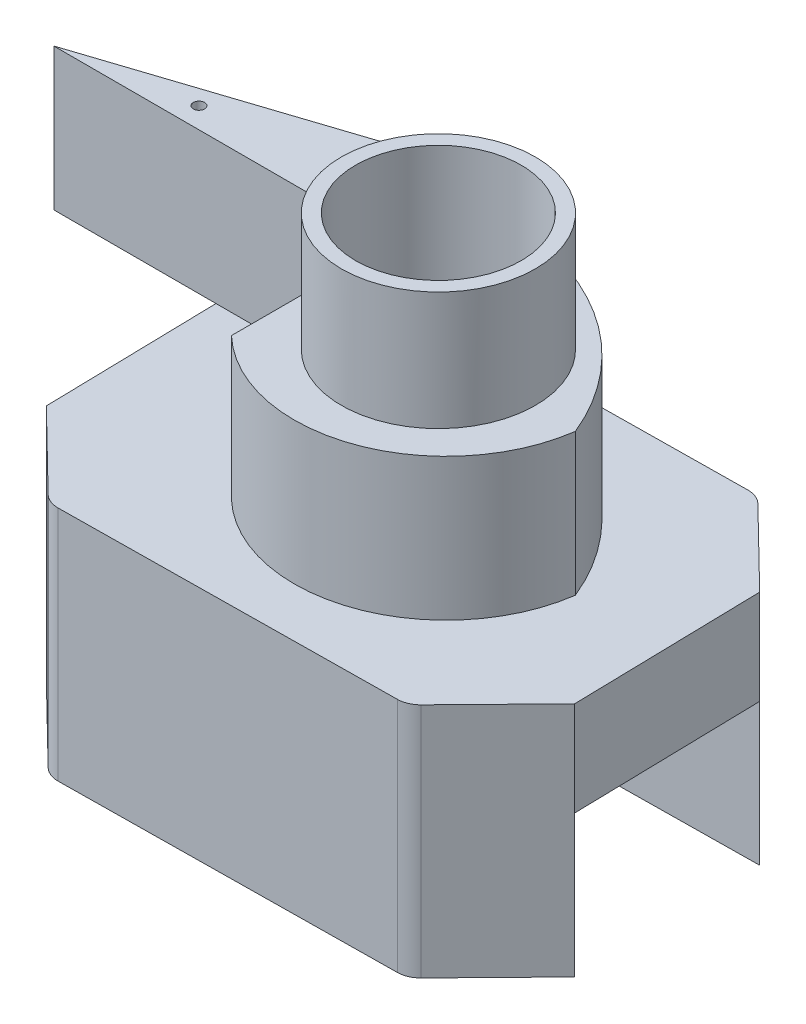
ISO-10303-21;
HEADER;
FILE_DESCRIPTION(('STEP AP214'),'2;1');
FILE_NAME('part.step','',(''),(''),'','','');
FILE_SCHEMA(('AUTOMOTIVE_DESIGN { 1 0 10303 214 1 1 1 1 }'));
ENDSEC;
DATA;
#1=APPLICATION_CONTEXT('core data for automotive mechanical design processes');
#2=APPLICATION_PROTOCOL_DEFINITION('international standard','automotive_design',2000,#1);
#3=PRODUCT_CONTEXT('',#1,'mechanical');
#4=PRODUCT('Part','Part','',(#3));
#5=PRODUCT_RELATED_PRODUCT_CATEGORY('part','',(#4));
#6=PRODUCT_DEFINITION_FORMATION('','',#4);
#7=PRODUCT_DEFINITION_CONTEXT('part definition',#1,'design');
#8=PRODUCT_DEFINITION('design','',#6,#7);
#9=PRODUCT_DEFINITION_SHAPE('','',#8);
#10=(LENGTH_UNIT() NAMED_UNIT(*) SI_UNIT(.MILLI.,.METRE.));
#11=(NAMED_UNIT(*) PLANE_ANGLE_UNIT() SI_UNIT($,.RADIAN.));
#12=(NAMED_UNIT(*) SI_UNIT($,.STERADIAN.) SOLID_ANGLE_UNIT());
#13=UNCERTAINTY_MEASURE_WITH_UNIT(LENGTH_MEASURE(1.E-05),#10,'distance_accuracy_value','');
#14=(GEOMETRIC_REPRESENTATION_CONTEXT(3) GLOBAL_UNCERTAINTY_ASSIGNED_CONTEXT((#13)) GLOBAL_UNIT_ASSIGNED_CONTEXT((#10,
#11,#12)) REPRESENTATION_CONTEXT('',''));
#15=CARTESIAN_POINT('',(0.,0.,0.));
#16=DIRECTION('',(0.,0.,1.));
#17=DIRECTION('',(1.,0.,0.));
#18=AXIS2_PLACEMENT_3D('',#15,#16,#17);
#19=CARTESIAN_POINT('',(0.,10.,0.));
#20=DIRECTION('',(0.,1.,0.));
#21=DIRECTION('',(0.,0.,1.));
#22=AXIS2_PLACEMENT_3D('',#19,#20,#21);
#23=PLANE('',#22);
#24=DIRECTION('',(-0.999930540162387,0.,0.0117862144285722));
#25=VECTOR('',#24,1.);
#26=CARTESIAN_POINT('',(8.21244562560331,10.,-7.40100076017394));
#27=LINE('',#26,#25);
#28=CARTESIAN_POINT('',(-4.09509511372916,10.,-7.25593136943546));
#29=VERTEX_POINT('',#28);
#30=CARTESIAN_POINT('',(-6.37336910363204,10.,-7.22907727838262));
#31=VERTEX_POINT('',#30);
#32=EDGE_CURVE('E265',#29,#31,#27,.T.);
#33=ORIENTED_EDGE('',*,*,#32,.T.);
#34=CARTESIAN_POINT('',(-6.36158288920348,10.,-6.22914673822024));
#35=DIRECTION('',(0.,1.,0.));
#36=DIRECTION('',(0.,0.,1.));
#37=AXIS2_PLACEMENT_3D('',#34,#35,#36);
#38=CIRCLE('',#37,1.);
#39=CARTESIAN_POINT('',(-7.07697523911702,10.,-6.92786970598728));
#40=VERTEX_POINT('',#39);
#41=EDGE_CURVE('E47',#31,#40,#38,.T.);
#42=ORIENTED_EDGE('',*,*,#41,.T.);
#43=DIRECTION('',(-0.69872296776704,0.,0.715392349913542));
#44=VECTOR('',#43,1.);
#45=CARTESIAN_POINT('',(-6.78755437439669,10.,-7.22419526286423));
#46=LINE('',#45,#44);
#47=CARTESIAN_POINT('',(-8.01213913003781,10.,-5.97039567930956));
#48=VERTEX_POINT('',#47);
#49=EDGE_CURVE('E272',#40,#48,#46,.T.);
#50=ORIENTED_EDGE('',*,*,#49,.T.);
#51=DIRECTION('',(-0.950139094586096,0.,0.311826395513776));
#52=VECTOR('',#51,1.);
#53=CARTESIAN_POINT('',(-17.1215909230103,10.,-2.98076233626041));
#54=LINE('',#53,#52);
#55=EDGE_CURVE('E209',#29,#48,#54,.T.);
#56=ORIENTED_EDGE('',*,*,#55,.F.);
#57=EDGE_LOOP('',(#33,#42,#50,#56));
#58=FACE_BOUND('',#57,.T.);
#59=ADVANCED_FACE('F38',(#58),#23,.T.);
#60=CARTESIAN_POINT('',(-10.2811692132319,10.,-3.64723351329652));
#61=DIRECTION('',(0.999755869242295,0.,-0.0220952917062123));
#62=DIRECTION('',(-0.0220952917062123,0.,-0.999755869242295));
#63=AXIS2_PLACEMENT_3D('',#60,#61,#62);
#64=PLANE('',#63);
#65=DIRECTION('',(0.0220952917062123,0.,0.999755869242295));
#66=VECTOR('',#65,1.);
#67=CARTESIAN_POINT('',(-10.1043637159222,6.,4.35276648670348));
#68=LINE('',#67,#66);
#69=CARTESIAN_POINT('',(-10.2811692132319,6.,-3.64723351329652));
#70=VERTEX_POINT('',#69);
#71=CARTESIAN_POINT('',(-10.1043637159222,6.,4.35276648670348));
#72=VERTEX_POINT('',#71);
#73=EDGE_CURVE('E227',#70,#72,#68,.T.);
#74=ORIENTED_EDGE('',*,*,#73,.T.);
#75=DIRECTION('',(0.,-1.,0.));
#76=VECTOR('',#75,1.);
#77=CARTESIAN_POINT('',(-10.1043637159222,10.,4.35276648670348));
#78=LINE('',#77,#76);
#79=CARTESIAN_POINT('',(-10.1043637159222,10.,4.35276648670348));
#80=VERTEX_POINT('',#79);
#81=EDGE_CURVE('E318',#80,#72,#78,.T.);
#82=ORIENTED_EDGE('',*,*,#81,.F.);
#83=DIRECTION('',(0.0220952917062123,0.,0.999755869242295));
#84=VECTOR('',#83,1.);
#85=CARTESIAN_POINT('',(-10.2811692132319,10.,-3.64723351329652));
#86=LINE('',#85,#84);
#87=CARTESIAN_POINT('',(-10.2664397422446,10.,-2.98076233626041));
#88=VERTEX_POINT('',#87);
#89=EDGE_CURVE('E275',#88,#80,#86,.T.);
#90=ORIENTED_EDGE('',*,*,#89,.F.);
#91=CARTESIAN_POINT('',(-10.2811692132319,10.,-3.64723351329652));
#92=VERTEX_POINT('',#91);
#93=EDGE_CURVE('E276',#92,#88,#86,.T.);
#94=ORIENTED_EDGE('',*,*,#93,.F.);
#95=DIRECTION('',(0.,-1.,0.));
#96=VECTOR('',#95,1.);
#97=CARTESIAN_POINT('',(-10.2811692132319,10.,-3.64723351329652));
#98=LINE('',#97,#96);
#99=EDGE_CURVE('E322',#92,#70,#98,.T.);
#100=ORIENTED_EDGE('',*,*,#99,.T.);
#101=EDGE_LOOP('',(#74,#82,#90,#94,#100));
#102=FACE_BOUND('',#101,.T.);
#103=ADVANCED_FACE('F415',(#102),#64,.F.);
#104=CARTESIAN_POINT('',(11.9662128724807,10.,4.09261407866126));
#105=DIRECTION('',(-0.999755869242295,0.,0.0220952917062113));
#106=DIRECTION('',(0.0220952917062113,0.,0.999755869242295));
#107=AXIS2_PLACEMENT_3D('',#104,#105,#106);
#108=PLANE('',#107);
#109=DIRECTION('',(-0.0220952917062113,0.,-0.999755869242295));
#110=VECTOR('',#109,1.);
#111=CARTESIAN_POINT('',(11.789407375171,6.,-3.90738592133874));
#112=LINE('',#111,#110);
#113=CARTESIAN_POINT('',(11.9662128724807,6.,4.09261407866126));
#114=VERTEX_POINT('',#113);
#115=CARTESIAN_POINT('',(11.789407375171,6.,-3.90738592133874));
#116=VERTEX_POINT('',#115);
#117=EDGE_CURVE('E234',#114,#116,#112,.T.);
#118=ORIENTED_EDGE('',*,*,#117,.T.);
#119=DIRECTION('',(0.,-1.,0.));
#120=VECTOR('',#119,1.);
#121=CARTESIAN_POINT('',(11.789407375171,10.,-3.90738592133874));
#122=LINE('',#121,#120);
#123=CARTESIAN_POINT('',(11.789407375171,10.,-3.90738592133874));
#124=VERTEX_POINT('',#123);
#125=EDGE_CURVE('E293',#124,#116,#122,.T.);
#126=ORIENTED_EDGE('',*,*,#125,.F.);
#127=DIRECTION('',(-0.0220952917062113,0.,-0.999755869242295));
#128=VECTOR('',#127,1.);
#129=CARTESIAN_POINT('',(11.9662128724807,10.,4.09261407866126));
#130=LINE('',#129,#128);
#131=CARTESIAN_POINT('',(11.9662128724807,10.,4.09261407866126));
#132=VERTEX_POINT('',#131);
#133=EDGE_CURVE('E290',#132,#124,#130,.T.);
#134=ORIENTED_EDGE('',*,*,#133,.F.);
#135=DIRECTION('',(0.,-1.,0.));
#136=VECTOR('',#135,1.);
#137=CARTESIAN_POINT('',(11.9662128724807,10.,4.09261407866126));
#138=LINE('',#137,#136);
#139=EDGE_CURVE('E314',#132,#114,#138,.T.);
#140=ORIENTED_EDGE('',*,*,#139,.T.);
#141=EDGE_LOOP('',(#118,#126,#134,#140));
#142=FACE_BOUND('',#141,.T.);
#143=ADVANCED_FACE('F406',(#142),#108,.F.);
#144=CARTESIAN_POINT('',(0.,0.,0.));
#145=DIRECTION('',(0.,1.,0.));
#146=DIRECTION('',(0.,0.,1.));
#147=AXIS2_PLACEMENT_3D('',#144,#145,#146);
#148=PLANE('',#147);
#149=DIRECTION('',(0.999930540162387,0.,-0.0117862144285723));
#150=VECTOR('',#149,1.);
#151=CARTESIAN_POINT('',(-6.52740196635446,0.,7.84638132553868));
#152=LINE('',#151,#150);
#153=CARTESIAN_POINT('',(-6.1132176547863,0.,7.84149932132637));
#154=VERTEX_POINT('',#153);
#155=CARTESIAN_POINT('',(8.05841276288089,0.,7.67445784374736));
#156=VERTEX_POINT('',#155);
#157=EDGE_CURVE('E306',#154,#156,#152,.T.);
#158=ORIENTED_EDGE('',*,*,#157,.F.);
#159=CARTESIAN_POINT('',(-6.12500386921488,0.,6.84156878116398));
#160=DIRECTION('',(0.,1.,0.));
#161=DIRECTION('',(0.,0.,1.));
#162=AXIS2_PLACEMENT_3D('',#159,#160,#161);
#163=CIRCLE('',#162,1.);
#164=CARTESIAN_POINT('',(-6.82372683698192,0.,7.55696113107753));
#165=VERTEX_POINT('',#164);
#166=EDGE_CURVE('E349',#154,#165,#163,.F.);
#167=ORIENTED_EDGE('',*,*,#166,.T.);
#168=DIRECTION('',(0.715392349913542,0.,0.69872296776704));
#169=VECTOR('',#168,1.);
#170=CARTESIAN_POINT('',(-10.1043637159222,0.,4.35276648670348));
#171=LINE('',#170,#169);
#172=CARTESIAN_POINT('',(-10.1043637159222,0.,4.35276648670348));
#173=VERTEX_POINT('',#172);
#174=EDGE_CURVE('E302',#173,#165,#171,.T.);
#175=ORIENTED_EDGE('',*,*,#174,.F.);
#176=DIRECTION('',(0.999930537070749,0.,-0.0117864767171782));
#177=VECTOR('',#176,1.);
#178=CARTESIAN_POINT('',(11.9662128724807,0.,4.09261407866126));
#179=LINE('',#178,#177);
#180=CARTESIAN_POINT('',(11.9662128724807,0.,4.09261407866126));
#181=VERTEX_POINT('',#180);
#182=EDGE_CURVE('E216',#173,#181,#179,.T.);
#183=ORIENTED_EDGE('',*,*,#182,.T.);
#184=DIRECTION('',(0.69872296776704,0.,-0.715392349913542));
#185=VECTOR('',#184,1.);
#186=CARTESIAN_POINT('',(8.47259803364553,0.,7.66957582822897));
#187=LINE('',#186,#185);
#188=CARTESIAN_POINT('',(8.76201889836586,0.,7.37325027135201));
#189=VERTEX_POINT('',#188);
#190=EDGE_CURVE('E266',#189,#181,#187,.T.);
#191=ORIENTED_EDGE('',*,*,#190,.F.);
#192=CARTESIAN_POINT('',(8.04662654845232,0.,6.67452730358497));
#193=DIRECTION('',(0.,1.,0.));
#194=DIRECTION('',(0.,0.,1.));
#195=AXIS2_PLACEMENT_3D('',#192,#193,#194);
#196=CIRCLE('',#195,1.);
#197=EDGE_CURVE('E334',#189,#156,#196,.F.);
#198=ORIENTED_EDGE('',*,*,#197,.T.);
#199=EDGE_LOOP('',(#158,#167,#175,#183,#191,#198));
#200=FACE_BOUND('',#199,.T.);
#201=ADVANCED_FACE('F515',(#200),#148,.F.);
#202=DIRECTION('',(-0.69872296776704,0.,0.715392349913542));
#203=VECTOR('',#202,1.);
#204=CARTESIAN_POINT('',(-6.78755437439669,0.,-7.22419526286423));
#205=LINE('',#204,#203);
#206=CARTESIAN_POINT('',(-7.07697523911702,0.,-6.92786970598728));
#207=VERTEX_POINT('',#206);
#208=CARTESIAN_POINT('',(-10.2811692132319,0.,-3.64723351329652));
#209=VERTEX_POINT('',#208);
#210=EDGE_CURVE('E299',#207,#209,#205,.T.);
#211=ORIENTED_EDGE('',*,*,#210,.F.);
#212=CARTESIAN_POINT('',(-6.36158288920348,0.,-6.22914673822024));
#213=DIRECTION('',(0.,1.,0.));
#214=DIRECTION('',(0.,0.,1.));
#215=AXIS2_PLACEMENT_3D('',#212,#213,#214);
#216=CIRCLE('',#215,1.);
#217=CARTESIAN_POINT('',(-6.37336910363204,0.,-7.22907727838262));
#218=VERTEX_POINT('',#217);
#219=EDGE_CURVE('E367',#207,#218,#216,.F.);
#220=ORIENTED_EDGE('',*,*,#219,.T.);
#221=DIRECTION('',(-0.999930540162387,0.,0.0117862144285722));
#222=VECTOR('',#221,1.);
#223=CARTESIAN_POINT('',(8.21244562560331,0.,-7.40100076017394));
#224=LINE('',#223,#222);
#225=CARTESIAN_POINT('',(7.79826131403516,0.,-7.39611875596163));
#226=VERTEX_POINT('',#225);
#227=EDGE_CURVE('E296',#226,#218,#224,.T.);
#228=ORIENTED_EDGE('',*,*,#227,.F.);
#229=CARTESIAN_POINT('',(7.81004752846373,0.,-6.39618821579924));
#230=DIRECTION('',(0.,1.,0.));
#231=DIRECTION('',(0.,0.,1.));
#232=AXIS2_PLACEMENT_3D('',#229,#230,#231);
#233=CIRCLE('',#232,1.);
#234=CARTESIAN_POINT('',(8.50877049623077,0.,-7.11158056571279));
#235=VERTEX_POINT('',#234);
#236=EDGE_CURVE('E62',#226,#235,#233,.F.);
#237=ORIENTED_EDGE('',*,*,#236,.T.);
#238=DIRECTION('',(-0.715392349913542,0.,-0.698722967767041));
#239=VECTOR('',#238,1.);
#240=CARTESIAN_POINT('',(11.789407375171,0.,-3.90738592133874));
#241=LINE('',#240,#239);
#242=CARTESIAN_POINT('',(11.789407375171,0.,-3.90738592133874));
#243=VERTEX_POINT('',#242);
#244=EDGE_CURVE('E260',#243,#235,#241,.T.);
#245=ORIENTED_EDGE('',*,*,#244,.F.);
#246=DIRECTION('',(-0.999930537070748,0.,0.0117864767171781));
#247=VECTOR('',#246,1.);
#248=CARTESIAN_POINT('',(-10.2811692132319,0.,-3.64723351329652));
#249=LINE('',#248,#247);
#250=EDGE_CURVE('E221',#243,#209,#249,.T.);
#251=ORIENTED_EDGE('',*,*,#250,.T.);
#252=EDGE_LOOP('',(#211,#220,#228,#237,#245,#251));
#253=FACE_BOUND('',#252,.T.);
#254=ADVANCED_FACE('F388',(#253),#148,.F.);
#255=CARTESIAN_POINT('',(11.789407375171,10.,-3.90738592133874));
#256=DIRECTION('',(-0.698722967767041,0.,0.715392349913542));
#257=DIRECTION('',(0.715392349913542,0.,0.698722967767041));
#258=AXIS2_PLACEMENT_3D('',#255,#256,#257);
#259=PLANE('',#258);
#260=ORIENTED_EDGE('',*,*,#244,.T.);
#261=DIRECTION('',(0.,-1.,0.));
#262=VECTOR('',#261,1.);
#263=CARTESIAN_POINT('',(8.50877049623077,10.,-7.11158056571279));
#264=LINE('',#263,#262);
#265=CARTESIAN_POINT('',(8.50877049623077,10.,-7.11158056571279));
#266=VERTEX_POINT('',#265);
#267=EDGE_CURVE('E11',#235,#266,#264,.F.);
#268=ORIENTED_EDGE('',*,*,#267,.T.);
#269=DIRECTION('',(-0.715392349913542,0.,-0.698722967767041));
#270=VECTOR('',#269,1.);
#271=CARTESIAN_POINT('',(11.789407375171,10.,-3.90738592133874));
#272=LINE('',#271,#270);
#273=EDGE_CURVE('E261',#124,#266,#272,.T.);
#274=ORIENTED_EDGE('',*,*,#273,.F.);
#275=ORIENTED_EDGE('',*,*,#125,.T.);
#276=DIRECTION('',(0.,-1.,0.));
#277=VECTOR('',#276,1.);
#278=CARTESIAN_POINT('',(11.789407375171,6.,-3.90738592133874));
#279=LINE('',#278,#277);
#280=EDGE_CURVE('E248',#116,#243,#279,.T.);
#281=ORIENTED_EDGE('',*,*,#280,.T.);
#282=EDGE_LOOP('',(#260,#268,#274,#275,#281));
#283=FACE_BOUND('',#282,.T.);
#284=ADVANCED_FACE('F398',(#283),#259,.F.);
#285=CARTESIAN_POINT('',(8.21244562560331,10.,-7.40100076017394));
#286=DIRECTION('',(0.0117862144285722,0.,0.999930540162387));
#287=DIRECTION('',(0.999930540162387,0.,-0.0117862144285722));
#288=AXIS2_PLACEMENT_3D('',#285,#286,#287);
#289=PLANE('',#288);
#290=ORIENTED_EDGE('',*,*,#227,.T.);
#291=DIRECTION('',(0.,-1.,0.));
#292=VECTOR('',#291,1.);
#293=CARTESIAN_POINT('',(-6.37336910363205,10.,-7.22907727838262));
#294=LINE('',#293,#292);
#295=EDGE_CURVE('E54',#218,#31,#294,.F.);
#296=ORIENTED_EDGE('',*,*,#295,.T.);
#297=ORIENTED_EDGE('',*,*,#32,.F.);
#298=CARTESIAN_POINT('',(-3.48196735983012,10.,-7.26315832659829));
#299=VERTEX_POINT('',#298);
#300=EDGE_CURVE('E271',#299,#29,#27,.T.);
#301=ORIENTED_EDGE('',*,*,#300,.F.);
#302=CARTESIAN_POINT('',(7.79826131403516,10.,-7.39611875596163));
#303=VERTEX_POINT('',#302);
#304=EDGE_CURVE('E267',#303,#299,#27,.T.);
#305=ORIENTED_EDGE('',*,*,#304,.F.);
#306=DIRECTION('',(0.,-1.,0.));
#307=VECTOR('',#306,1.);
#308=CARTESIAN_POINT('',(7.79826131403516,10.,-7.39611875596163));
#309=LINE('',#308,#307);
#310=EDGE_CURVE('E370',#303,#226,#309,.T.);
#311=ORIENTED_EDGE('',*,*,#310,.T.);
#312=EDGE_LOOP('',(#290,#296,#297,#301,#305,#311));
#313=FACE_BOUND('',#312,.T.);
#314=ADVANCED_FACE('F389',(#313),#289,.F.);
#315=CARTESIAN_POINT('',(-6.78755437439669,10.,-7.22419526286423));
#316=DIRECTION('',(0.715392349913542,0.,0.69872296776704));
#317=DIRECTION('',(0.69872296776704,0.,-0.715392349913542));
#318=AXIS2_PLACEMENT_3D('',#315,#316,#317);
#319=PLANE('',#318);
#320=ORIENTED_EDGE('',*,*,#49,.F.);
#321=DIRECTION('',(0.,-1.,0.));
#322=VECTOR('',#321,1.);
#323=CARTESIAN_POINT('',(-7.07697523911702,10.,-6.92786970598728));
#324=LINE('',#323,#322);
#325=EDGE_CURVE('E361',#40,#207,#324,.T.);
#326=ORIENTED_EDGE('',*,*,#325,.T.);
#327=ORIENTED_EDGE('',*,*,#210,.T.);
#328=DIRECTION('',(0.,-1.,0.));
#329=VECTOR('',#328,1.);
#330=CARTESIAN_POINT('',(-10.2811692132319,6.,-3.64723351329652));
#331=LINE('',#330,#329);
#332=EDGE_CURVE('E240',#70,#209,#331,.T.);
#333=ORIENTED_EDGE('',*,*,#332,.F.);
#334=ORIENTED_EDGE('',*,*,#99,.F.);
#335=EDGE_CURVE('E270',#48,#92,#46,.T.);
#336=ORIENTED_EDGE('',*,*,#335,.F.);
#337=EDGE_LOOP('',(#320,#326,#327,#333,#334,#336));
#338=FACE_BOUND('',#337,.T.);
#339=ADVANCED_FACE('F383',(#338),#319,.F.);
#340=CARTESIAN_POINT('',(-10.1043637159222,10.,4.35276648670348));
#341=DIRECTION('',(0.69872296776704,0.,-0.715392349913542));
#342=DIRECTION('',(-0.715392349913542,0.,-0.69872296776704));
#343=AXIS2_PLACEMENT_3D('',#340,#341,#342);
#344=PLANE('',#343);
#345=ORIENTED_EDGE('',*,*,#174,.T.);
#346=DIRECTION('',(0.,-1.,0.));
#347=VECTOR('',#346,1.);
#348=CARTESIAN_POINT('',(-6.82372683698192,10.,7.55696113107753));
#349=LINE('',#348,#347);
#350=CARTESIAN_POINT('',(-6.82372683698192,10.,7.55696113107753));
#351=VERTEX_POINT('',#350);
#352=EDGE_CURVE('E352',#165,#351,#349,.F.);
#353=ORIENTED_EDGE('',*,*,#352,.T.);
#354=DIRECTION('',(0.715392349913542,0.,0.69872296776704));
#355=VECTOR('',#354,1.);
#356=CARTESIAN_POINT('',(-10.1043637159222,10.,4.35276648670348));
#357=LINE('',#356,#355);
#358=EDGE_CURVE('E280',#80,#351,#357,.T.);
#359=ORIENTED_EDGE('',*,*,#358,.F.);
#360=ORIENTED_EDGE('',*,*,#81,.T.);
#361=DIRECTION('',(0.,-1.,0.));
#362=VECTOR('',#361,1.);
#363=CARTESIAN_POINT('',(-10.1043637159222,6.,4.35276648670348));
#364=LINE('',#363,#362);
#365=EDGE_CURVE('E256',#72,#173,#364,.T.);
#366=ORIENTED_EDGE('',*,*,#365,.T.);
#367=EDGE_LOOP('',(#345,#353,#359,#360,#366));
#368=FACE_BOUND('',#367,.T.);
#369=ADVANCED_FACE('F492',(#368),#344,.F.);
#370=CARTESIAN_POINT('',(-6.52740196635446,10.,7.84638132553868));
#371=DIRECTION('',(-0.0117862144285723,0.,-0.999930540162387));
#372=DIRECTION('',(-0.999930540162387,0.,0.0117862144285723));
#373=AXIS2_PLACEMENT_3D('',#370,#371,#372);
#374=PLANE('',#373);
#375=DIRECTION('',(0.999930540162387,0.,-0.0117862144285723));
#376=VECTOR('',#375,1.);
#377=CARTESIAN_POINT('',(-6.52740196635446,10.,7.84638132553868));
#378=LINE('',#377,#376);
#379=CARTESIAN_POINT('',(-6.1132176547863,10.,7.84149932132637));
#380=VERTEX_POINT('',#379);
#381=CARTESIAN_POINT('',(8.05841276288089,10.,7.67445784374736));
#382=VERTEX_POINT('',#381);
#383=EDGE_CURVE('E284',#380,#382,#378,.T.);
#384=ORIENTED_EDGE('',*,*,#383,.F.);
#385=DIRECTION('',(0.,-1.,0.));
#386=VECTOR('',#385,1.);
#387=CARTESIAN_POINT('',(-6.1132176547863,10.,7.84149932132637));
#388=LINE('',#387,#386);
#389=EDGE_CURVE('E345',#380,#154,#388,.T.);
#390=ORIENTED_EDGE('',*,*,#389,.T.);
#391=ORIENTED_EDGE('',*,*,#157,.T.);
#392=DIRECTION('',(0.,-1.,0.));
#393=VECTOR('',#392,1.);
#394=CARTESIAN_POINT('',(8.05841276288089,10.,7.67445784374736));
#395=LINE('',#394,#393);
#396=EDGE_CURVE('E338',#156,#382,#395,.F.);
#397=ORIENTED_EDGE('',*,*,#396,.T.);
#398=EDGE_LOOP('',(#384,#390,#391,#397));
#399=FACE_BOUND('',#398,.T.);
#400=ADVANCED_FACE('F500',(#399),#374,.F.);
#401=CARTESIAN_POINT('',(8.47259803364553,10.,7.66957582822897));
#402=DIRECTION('',(-0.715392349913542,0.,-0.69872296776704));
#403=DIRECTION('',(-0.69872296776704,0.,0.715392349913542));
#404=AXIS2_PLACEMENT_3D('',#401,#402,#403);
#405=PLANE('',#404);
#406=DIRECTION('',(0.69872296776704,0.,-0.715392349913542));
#407=VECTOR('',#406,1.);
#408=CARTESIAN_POINT('',(8.47259803364553,10.,7.66957582822897));
#409=LINE('',#408,#407);
#410=CARTESIAN_POINT('',(8.76201889836586,10.,7.37325027135201));
#411=VERTEX_POINT('',#410);
#412=EDGE_CURVE('E287',#411,#132,#409,.T.);
#413=ORIENTED_EDGE('',*,*,#412,.F.);
#414=DIRECTION('',(0.,-1.,0.));
#415=VECTOR('',#414,1.);
#416=CARTESIAN_POINT('',(8.76201889836586,10.,7.37325027135201));
#417=LINE('',#416,#415);
#418=EDGE_CURVE('E330',#411,#189,#417,.T.);
#419=ORIENTED_EDGE('',*,*,#418,.T.);
#420=ORIENTED_EDGE('',*,*,#190,.T.);
#421=DIRECTION('',(0.,-1.,0.));
#422=VECTOR('',#421,1.);
#423=CARTESIAN_POINT('',(11.9662128724807,6.,4.09261407866126));
#424=LINE('',#423,#422);
#425=EDGE_CURVE('E252',#114,#181,#424,.T.);
#426=ORIENTED_EDGE('',*,*,#425,.F.);
#427=ORIENTED_EDGE('',*,*,#139,.F.);
#428=EDGE_LOOP('',(#413,#419,#420,#426,#427));
#429=FACE_BOUND('',#428,.T.);
#430=ADVANCED_FACE('F508',(#429),#405,.F.);
#431=ORIENTED_EDGE('',*,*,#358,.T.);
#432=CARTESIAN_POINT('',(-6.12500386921488,10.,6.84156878116398));
#433=DIRECTION('',(0.,1.,0.));
#434=DIRECTION('',(0.,0.,1.));
#435=AXIS2_PLACEMENT_3D('',#432,#433,#434);
#436=CIRCLE('',#435,1.);
#437=EDGE_CURVE('E358',#351,#380,#436,.T.);
#438=ORIENTED_EDGE('',*,*,#437,.T.);
#439=ORIENTED_EDGE('',*,*,#383,.T.);
#440=CARTESIAN_POINT('',(8.04662654845232,10.,6.67452730358497));
#441=DIRECTION('',(0.,1.,0.));
#442=DIRECTION('',(0.,0.,1.));
#443=AXIS2_PLACEMENT_3D('',#440,#441,#442);
#444=CIRCLE('',#443,1.);
#445=EDGE_CURVE('E342',#382,#411,#444,.T.);
#446=ORIENTED_EDGE('',*,*,#445,.T.);
#447=ORIENTED_EDGE('',*,*,#412,.T.);
#448=ORIENTED_EDGE('',*,*,#133,.T.);
#449=ORIENTED_EDGE('',*,*,#273,.T.);
#450=CARTESIAN_POINT('',(7.81004752846373,10.,-6.39618821579924));
#451=DIRECTION('',(0.,1.,0.));
#452=DIRECTION('',(0.,0.,1.));
#453=AXIS2_PLACEMENT_3D('',#450,#451,#452);
#454=CIRCLE('',#453,1.);
#455=EDGE_CURVE('E355',#266,#303,#454,.T.);
#456=ORIENTED_EDGE('',*,*,#455,.T.);
#457=ORIENTED_EDGE('',*,*,#304,.T.);
#458=CARTESIAN_POINT('',(-3.77706657198527,10.,-6.28689425438557));
#459=DIRECTION('',(0.,1.,0.));
#460=DIRECTION('',(0.,0.,-1.));
#461=AXIS2_PLACEMENT_3D('',#458,#459,#460);
#462=CIRCLE('',#461,1.01988974095632);
#463=CARTESIAN_POINT('',(-2.76620641461633,10.,-6.15148071757332));
#464=VERTEX_POINT('',#463);
#465=EDGE_CURVE('E441',#464,#299,#462,.T.);
#466=ORIENTED_EDGE('',*,*,#465,.F.);
#467=CARTESIAN_POINT('',(-1.43304106761742,10.,3.96101997006875));
#468=DIRECTION('',(0.,1.,0.));
#469=DIRECTION('',(0.,0.,-1.));
#470=AXIS2_PLACEMENT_3D('',#467,#468,#469);
#471=CIRCLE('',#470,10.2);
#472=CARTESIAN_POINT('',(8.00874673540164,10.,0.101921230367924));
#473=VERTEX_POINT('',#472);
#474=EDGE_CURVE('E443',#473,#464,#471,.T.);
#475=ORIENTED_EDGE('',*,*,#474,.F.);
#476=CARTESIAN_POINT('',(1.65289700409273,10.,-0.78709624817711));
#477=DIRECTION('',(0.,1.,0.));
#478=DIRECTION('',(0.,0.,-1.));
#479=AXIS2_PLACEMENT_3D('',#476,#477,#478);
#480=CIRCLE('',#479,6.41772373074271);
#481=CARTESIAN_POINT('',(-2.76620641461633,10.,3.86679490427715));
#482=VERTEX_POINT('',#481);
#483=EDGE_CURVE('E468',#482,#473,#480,.T.);
#484=ORIENTED_EDGE('',*,*,#483,.F.);
#485=DIRECTION('',(0.,0.,1.));
#486=VECTOR('',#485,1.);
#487=CARTESIAN_POINT('',(-2.76620641461634,10.,3.86679490427714));
#488=LINE('',#487,#486);
#489=CARTESIAN_POINT('',(-2.76620641461633,10.,-2.98076233626041));
#490=VERTEX_POINT('',#489);
#491=EDGE_CURVE('E470',#490,#482,#488,.T.);
#492=ORIENTED_EDGE('',*,*,#491,.F.);
#493=DIRECTION('',(1.,0.,0.));
#494=VECTOR('',#493,1.);
#495=CARTESIAN_POINT('',(-2.76620641461633,10.,-2.98076233626041));
#496=LINE('',#495,#494);
#497=EDGE_CURVE('E214',#88,#490,#496,.T.);
#498=ORIENTED_EDGE('',*,*,#497,.F.);
#499=ORIENTED_EDGE('',*,*,#89,.T.);
#500=EDGE_LOOP('',(#431,#438,#439,#446,#447,#448,#449,#456,#457,#466,#475,#484,#492,#498,#499));
#501=FACE_BOUND('',#500,.T.);
#502=ADVANCED_FACE('F400',(#501),#23,.T.);
#503=CARTESIAN_POINT('',(11.9662128724807,6.,4.09261407866126));
#504=DIRECTION('',(-0.0117864767171782,0.,-0.999930537070748));
#505=DIRECTION('',(-0.999930537070749,0.,0.0117864767171782));
#506=AXIS2_PLACEMENT_3D('',#503,#504,#505);
#507=PLANE('',#506);
#508=ORIENTED_EDGE('',*,*,#182,.F.);
#509=ORIENTED_EDGE('',*,*,#365,.F.);
#510=DIRECTION('',(0.999930537070749,0.,-0.0117864767171782));
#511=VECTOR('',#510,1.);
#512=CARTESIAN_POINT('',(11.9662128724807,6.,4.09261407866126));
#513=LINE('',#512,#511);
#514=EDGE_CURVE('E231',#72,#114,#513,.T.);
#515=ORIENTED_EDGE('',*,*,#514,.T.);
#516=ORIENTED_EDGE('',*,*,#425,.T.);
#517=EDGE_LOOP('',(#508,#509,#515,#516));
#518=FACE_BOUND('',#517,.T.);
#519=ADVANCED_FACE('F512',(#518),#507,.T.);
#520=CARTESIAN_POINT('',(-10.2811692132319,6.,-3.64723351329652));
#521=DIRECTION('',(0.0117864767171781,0.,0.999930537070748));
#522=DIRECTION('',(0.999930537070748,0.,-0.0117864767171781));
#523=AXIS2_PLACEMENT_3D('',#520,#521,#522);
#524=PLANE('',#523);
#525=ORIENTED_EDGE('',*,*,#250,.F.);
#526=ORIENTED_EDGE('',*,*,#280,.F.);
#527=DIRECTION('',(-0.999930537070748,0.,0.0117864767171781));
#528=VECTOR('',#527,1.);
#529=CARTESIAN_POINT('',(-10.2811692132319,6.,-3.64723351329652));
#530=LINE('',#529,#528);
#531=EDGE_CURVE('E238',#116,#70,#530,.T.);
#532=ORIENTED_EDGE('',*,*,#531,.T.);
#533=ORIENTED_EDGE('',*,*,#332,.T.);
#534=EDGE_LOOP('',(#525,#526,#532,#533));
#535=FACE_BOUND('',#534,.T.);
#536=ADVANCED_FACE('F410',(#535),#524,.T.);
#537=CARTESIAN_POINT('',(0.,6.,0.));
#538=DIRECTION('',(0.,-1.,0.));
#539=DIRECTION('',(0.,0.,-1.));
#540=AXIS2_PLACEMENT_3D('',#537,#538,#539);
#541=PLANE('',#540);
#542=CARTESIAN_POINT('',(2.1162848080931,5.99999999999999,0.));
#543=DIRECTION('',(0.,1.,0.));
#544=DIRECTION('',(0.,0.,1.));
#545=AXIS2_PLACEMENT_3D('',#542,#543,#544);
#546=CIRCLE('',#545,3.5);
#547=CARTESIAN_POINT('',(2.1162848080931,5.99999999999999,3.5));
#548=VERTEX_POINT('',#547);
#549=EDGE_CURVE('E485',#548,#548,#546,.T.);
#550=ORIENTED_EDGE('',*,*,#549,.T.);
#551=EDGE_LOOP('',(#550));
#552=FACE_BOUND('',#551,.T.);
#553=ORIENTED_EDGE('',*,*,#73,.F.);
#554=ORIENTED_EDGE('',*,*,#531,.F.);
#555=ORIENTED_EDGE('',*,*,#117,.F.);
#556=ORIENTED_EDGE('',*,*,#514,.F.);
#557=EDGE_LOOP('',(#553,#554,#555,#556));
#558=FACE_BOUND('',#557,.T.);
#559=ADVANCED_FACE('F690',(#552,#558),#541,.T.);
#560=CARTESIAN_POINT('',(-3.77706657198527,10.,-6.28689425438557));
#561=DIRECTION('',(0.,-1.,0.));
#562=DIRECTION('',(0.,0.,-1.));
#563=AXIS2_PLACEMENT_3D('',#560,#561,#562);
#564=PLANE('',#563);
#565=EDGE_CURVE('E432',#299,#29,#462,.T.);
#566=ORIENTED_EDGE('',*,*,#565,.F.);
#567=ORIENTED_EDGE('',*,*,#300,.T.);
#568=EDGE_LOOP('',(#566,#567));
#569=FACE_BOUND('',#568,.T.);
#570=ADVANCED_FACE('F431',(#569),#564,.T.);
#571=CARTESIAN_POINT('',(-2.76620641461633,16.,-2.98076233626041));
#572=DIRECTION('',(0.,0.,-1.));
#573=DIRECTION('',(-1.,0.,0.));
#574=AXIS2_PLACEMENT_3D('',#571,#572,#573);
#575=PLANE('',#574);
#576=CARTESIAN_POINT('',(-17.1215909230103,10.,-2.98076233626041));
#577=VERTEX_POINT('',#576);
#578=EDGE_CURVE('E475',#577,#88,#496,.T.);
#579=ORIENTED_EDGE('',*,*,#578,.T.);
#580=ORIENTED_EDGE('',*,*,#497,.T.);
#581=DIRECTION('',(0.,-1.,0.));
#582=VECTOR('',#581,1.);
#583=CARTESIAN_POINT('',(-2.76620641461633,16.,-2.98076233626041));
#584=LINE('',#583,#582);
#585=CARTESIAN_POINT('',(-2.76620641461633,16.,-2.98076233626041));
#586=VERTEX_POINT('',#585);
#587=EDGE_CURVE('E192',#586,#490,#584,.T.);
#588=ORIENTED_EDGE('',*,*,#587,.F.);
#589=DIRECTION('',(1.,0.,0.));
#590=VECTOR('',#589,1.);
#591=CARTESIAN_POINT('',(-2.76620641461633,16.,-2.98076233626041));
#592=LINE('',#591,#590);
#593=CARTESIAN_POINT('',(-17.1215909230103,16.,-2.98076233626041));
#594=VERTEX_POINT('',#593);
#595=EDGE_CURVE('E199',#594,#586,#592,.T.);
#596=ORIENTED_EDGE('',*,*,#595,.F.);
#597=DIRECTION('',(0.,-1.,0.));
#598=VECTOR('',#597,1.);
#599=CARTESIAN_POINT('',(-17.1215909230103,16.,-2.98076233626041));
#600=LINE('',#599,#598);
#601=EDGE_CURVE('E449',#594,#577,#600,.T.);
#602=ORIENTED_EDGE('',*,*,#601,.T.);
#603=EDGE_LOOP('',(#579,#580,#588,#596,#602));
#604=FACE_BOUND('',#603,.T.);
#605=ADVANCED_FACE('F213',(#604),#575,.F.);
#606=CARTESIAN_POINT('',(-2.76620641461634,16.,3.86679490427714));
#607=DIRECTION('',(1.,0.,0.));
#608=DIRECTION('',(0.,0.,-1.));
#609=AXIS2_PLACEMENT_3D('',#606,#607,#608);
#610=PLANE('',#609);
#611=ORIENTED_EDGE('',*,*,#491,.T.);
#612=DIRECTION('',(0.,-1.,0.));
#613=VECTOR('',#612,1.);
#614=CARTESIAN_POINT('',(-2.76620641461633,16.,3.86679490427715));
#615=LINE('',#614,#613);
#616=CARTESIAN_POINT('',(-2.76620641461633,16.,3.86679490427715));
#617=VERTEX_POINT('',#616);
#618=EDGE_CURVE('E194',#617,#482,#615,.T.);
#619=ORIENTED_EDGE('',*,*,#618,.F.);
#620=DIRECTION('',(0.,0.,1.));
#621=VECTOR('',#620,1.);
#622=CARTESIAN_POINT('',(-2.76620641461634,16.,3.86679490427714));
#623=LINE('',#622,#621);
#624=EDGE_CURVE('E187',#586,#617,#623,.T.);
#625=ORIENTED_EDGE('',*,*,#624,.F.);
#626=ORIENTED_EDGE('',*,*,#587,.T.);
#627=EDGE_LOOP('',(#611,#619,#625,#626));
#628=FACE_BOUND('',#627,.T.);
#629=ADVANCED_FACE('F190',(#628),#610,.F.);
#630=CARTESIAN_POINT('',(1.65289700409273,16.,-0.78709624817711));
#631=DIRECTION('',(0.,-1.,0.));
#632=DIRECTION('',(0.,0.,-1.));
#633=AXIS2_PLACEMENT_3D('',#630,#631,#632);
#634=CYLINDRICAL_SURFACE('',#633,6.41772373074271);
#635=ORIENTED_EDGE('',*,*,#483,.T.);
#636=DIRECTION('',(0.,-1.,0.));
#637=VECTOR('',#636,1.);
#638=CARTESIAN_POINT('',(8.00874673540164,16.,0.101921230367924));
#639=LINE('',#638,#637);
#640=CARTESIAN_POINT('',(8.00874673540164,16.,0.101921230367924));
#641=VERTEX_POINT('',#640);
#642=EDGE_CURVE('E223',#641,#473,#639,.T.);
#643=ORIENTED_EDGE('',*,*,#642,.F.);
#644=CARTESIAN_POINT('',(1.65289700409273,16.,-0.78709624817711));
#645=DIRECTION('',(0.,1.,0.));
#646=DIRECTION('',(0.,0.,-1.));
#647=AXIS2_PLACEMENT_3D('',#644,#645,#646);
#648=CIRCLE('',#647,6.41772373074271);
#649=EDGE_CURVE('E198',#617,#641,#648,.T.);
#650=ORIENTED_EDGE('',*,*,#649,.F.);
#651=ORIENTED_EDGE('',*,*,#618,.T.);
#652=EDGE_LOOP('',(#635,#643,#650,#651));
#653=FACE_BOUND('',#652,.T.);
#654=ADVANCED_FACE('F467',(#653),#634,.T.);
#655=CARTESIAN_POINT('',(-1.43304106761742,16.,3.96101997006875));
#656=DIRECTION('',(0.,-1.,0.));
#657=DIRECTION('',(0.,0.,-1.));
#658=AXIS2_PLACEMENT_3D('',#655,#656,#657);
#659=CYLINDRICAL_SURFACE('',#658,10.2);
#660=ORIENTED_EDGE('',*,*,#474,.T.);
#661=DIRECTION('',(0.,-1.,0.));
#662=VECTOR('',#661,1.);
#663=CARTESIAN_POINT('',(-2.76620641461633,16.,-6.15148071757332));
#664=LINE('',#663,#662);
#665=CARTESIAN_POINT('',(-2.76620641461633,16.,-6.15148071757332));
#666=VERTEX_POINT('',#665);
#667=EDGE_CURVE('E448',#666,#464,#664,.T.);
#668=ORIENTED_EDGE('',*,*,#667,.F.);
#669=CARTESIAN_POINT('',(-1.43304106761742,16.,3.96101997006875));
#670=DIRECTION('',(0.,1.,0.));
#671=DIRECTION('',(0.,0.,-1.));
#672=AXIS2_PLACEMENT_3D('',#669,#670,#671);
#673=CIRCLE('',#672,10.2);
#674=EDGE_CURVE('E464',#641,#666,#673,.T.);
#675=ORIENTED_EDGE('',*,*,#674,.F.);
#676=ORIENTED_EDGE('',*,*,#642,.T.);
#677=EDGE_LOOP('',(#660,#668,#675,#676));
#678=FACE_BOUND('',#677,.T.);
#679=ADVANCED_FACE('F462',(#678),#659,.T.);
#680=CARTESIAN_POINT('',(-3.77706657198527,16.,-6.28689425438557));
#681=DIRECTION('',(0.,-1.,0.));
#682=DIRECTION('',(0.,0.,-1.));
#683=AXIS2_PLACEMENT_3D('',#680,#681,#682);
#684=CYLINDRICAL_SURFACE('',#683,1.01988974095632);
#685=ORIENTED_EDGE('',*,*,#465,.T.);
#686=ORIENTED_EDGE('',*,*,#565,.T.);
#687=DIRECTION('',(0.,-1.,0.));
#688=VECTOR('',#687,1.);
#689=CARTESIAN_POINT('',(-4.09509511372916,16.,-7.25593136943546));
#690=LINE('',#689,#688);
#691=CARTESIAN_POINT('',(-4.09509511372916,16.,-7.25593136943546));
#692=VERTEX_POINT('',#691);
#693=EDGE_CURVE('E439',#692,#29,#690,.T.);
#694=ORIENTED_EDGE('',*,*,#693,.F.);
#695=CARTESIAN_POINT('',(-3.77706657198527,16.,-6.28689425438557));
#696=DIRECTION('',(0.,1.,0.));
#697=DIRECTION('',(0.,0.,-1.));
#698=AXIS2_PLACEMENT_3D('',#695,#696,#697);
#699=CIRCLE('',#698,1.01988974095632);
#700=EDGE_CURVE('E811',#666,#692,#699,.T.);
#701=ORIENTED_EDGE('',*,*,#700,.F.);
#702=ORIENTED_EDGE('',*,*,#667,.T.);
#703=EDGE_LOOP('',(#685,#686,#694,#701,#702));
#704=FACE_BOUND('',#703,.T.);
#705=ADVANCED_FACE('F437',(#704),#684,.T.);
#706=CARTESIAN_POINT('',(-17.1215909230103,16.,-2.98076233626041));
#707=DIRECTION('',(0.311826395513776,0.,0.950139094586096));
#708=DIRECTION('',(0.950139094586096,0.,-0.311826395513776));
#709=AXIS2_PLACEMENT_3D('',#706,#707,#708);
#710=PLANE('',#709);
#711=ORIENTED_EDGE('',*,*,#55,.T.);
#712=EDGE_CURVE('E421',#48,#577,#54,.T.);
#713=ORIENTED_EDGE('',*,*,#712,.T.);
#714=ORIENTED_EDGE('',*,*,#601,.F.);
#715=DIRECTION('',(-0.950139094586096,0.,0.311826395513776));
#716=VECTOR('',#715,1.);
#717=CARTESIAN_POINT('',(-17.1215909230103,16.,-2.98076233626041));
#718=LINE('',#717,#716);
#719=EDGE_CURVE('E204',#692,#594,#718,.T.);
#720=ORIENTED_EDGE('',*,*,#719,.F.);
#721=ORIENTED_EDGE('',*,*,#693,.T.);
#722=EDGE_LOOP('',(#711,#713,#714,#720,#721));
#723=FACE_BOUND('',#722,.T.);
#724=ADVANCED_FACE('F446',(#723),#710,.F.);
#725=CARTESIAN_POINT('',(-3.77706657198527,16.,-6.28689425438557));
#726=DIRECTION('',(0.,-1.,0.));
#727=DIRECTION('',(0.,0.,-1.));
#728=AXIS2_PLACEMENT_3D('',#725,#726,#727);
#729=PLANE('',#728);
#730=CARTESIAN_POINT('',(-11.8682055276459,16.,-3.86289026558884));
#731=DIRECTION('',(0.,1.,0.));
#732=DIRECTION('',(0.,0.,1.));
#733=AXIS2_PLACEMENT_3D('',#730,#731,#732);
#734=CIRCLE('',#733,0.238796937567521);
#735=CARTESIAN_POINT('',(-11.8682055276459,16.,-3.62409332802131));
#736=VERTEX_POINT('',#735);
#737=EDGE_CURVE('E804',#736,#736,#734,.T.);
#738=ORIENTED_EDGE('',*,*,#737,.F.);
#739=EDGE_LOOP('',(#738));
#740=FACE_BOUND('',#739,.T.);
#741=CARTESIAN_POINT('',(2.1162848080931,16.,0.));
#742=DIRECTION('',(0.,-1.,0.));
#743=DIRECTION('',(0.,0.,-1.));
#744=AXIS2_PLACEMENT_3D('',#741,#742,#743);
#745=CIRCLE('',#744,4.1);
#746=CARTESIAN_POINT('',(2.1162848080931,16.,-4.1));
#747=VERTEX_POINT('',#746);
#748=EDGE_CURVE('E326',#747,#747,#745,.F.);
#749=ORIENTED_EDGE('',*,*,#748,.F.);
#750=EDGE_LOOP('',(#749));
#751=FACE_BOUND('',#750,.T.);
#752=ORIENTED_EDGE('',*,*,#595,.T.);
#753=ORIENTED_EDGE('',*,*,#624,.T.);
#754=ORIENTED_EDGE('',*,*,#649,.T.);
#755=ORIENTED_EDGE('',*,*,#674,.T.);
#756=ORIENTED_EDGE('',*,*,#700,.T.);
#757=ORIENTED_EDGE('',*,*,#719,.T.);
#758=EDGE_LOOP('',(#752,#753,#754,#755,#756,#757));
#759=FACE_BOUND('',#758,.T.);
#760=ADVANCED_FACE('F202',(#740,#751,#759),#729,.F.);
#761=ORIENTED_EDGE('',*,*,#712,.F.);
#762=ORIENTED_EDGE('',*,*,#335,.T.);
#763=ORIENTED_EDGE('',*,*,#93,.T.);
#764=ORIENTED_EDGE('',*,*,#578,.F.);
#765=EDGE_LOOP('',(#761,#762,#763,#764));
#766=FACE_BOUND('',#765,.T.);
#767=ADVANCED_FACE('F420',(#766),#564,.T.);
#768=CARTESIAN_POINT('',(2.1162848080931,21.,0.));
#769=DIRECTION('',(0.,-1.,0.));
#770=DIRECTION('',(0.,0.,-1.));
#771=AXIS2_PLACEMENT_3D('',#768,#769,#770);
#772=CYLINDRICAL_SURFACE('',#771,4.1);
#773=CARTESIAN_POINT('',(2.1162848080931,21.,0.));
#774=DIRECTION('',(0.,1.,0.));
#775=DIRECTION('',(0.,0.,1.));
#776=AXIS2_PLACEMENT_3D('',#773,#774,#775);
#777=CIRCLE('',#776,4.1);
#778=CARTESIAN_POINT('',(2.1162848080931,21.,4.1));
#779=VERTEX_POINT('',#778);
#780=EDGE_CURVE('E482',#779,#779,#777,.T.);
#781=ORIENTED_EDGE('',*,*,#780,.F.);
#782=EDGE_LOOP('',(#781));
#783=FACE_BOUND('',#782,.T.);
#784=ORIENTED_EDGE('',*,*,#748,.T.);
#785=EDGE_LOOP('',(#784));
#786=FACE_BOUND('',#785,.T.);
#787=ADVANCED_FACE('F682',(#783,#786),#772,.T.);
#788=CARTESIAN_POINT('',(2.1162848080931,21.,0.));
#789=DIRECTION('',(0.,1.,0.));
#790=DIRECTION('',(0.,0.,1.));
#791=AXIS2_PLACEMENT_3D('',#788,#789,#790);
#792=PLANE('',#791);
#793=CARTESIAN_POINT('',(2.1162848080931,21.,0.));
#794=DIRECTION('',(0.,1.,0.));
#795=DIRECTION('',(0.,0.,1.));
#796=AXIS2_PLACEMENT_3D('',#793,#794,#795);
#797=CIRCLE('',#796,3.5);
#798=CARTESIAN_POINT('',(2.1162848080931,21.,3.5));
#799=VERTEX_POINT('',#798);
#800=EDGE_CURVE('E797',#799,#799,#797,.T.);
#801=ORIENTED_EDGE('',*,*,#800,.F.);
#802=EDGE_LOOP('',(#801));
#803=FACE_BOUND('',#802,.T.);
#804=ORIENTED_EDGE('',*,*,#780,.T.);
#805=EDGE_LOOP('',(#804));
#806=FACE_BOUND('',#805,.T.);
#807=ADVANCED_FACE('F672',(#803,#806),#792,.T.);
#808=CARTESIAN_POINT('',(2.1162848080931,5.99999999999999,0.));
#809=DIRECTION('',(0.,1.,0.));
#810=DIRECTION('',(0.,0.,1.));
#811=AXIS2_PLACEMENT_3D('',#808,#809,#810);
#812=CYLINDRICAL_SURFACE('',#811,3.5);
#813=ORIENTED_EDGE('',*,*,#549,.F.);
#814=EDGE_LOOP('',(#813));
#815=FACE_BOUND('',#814,.T.);
#816=ORIENTED_EDGE('',*,*,#800,.T.);
#817=EDGE_LOOP('',(#816));
#818=FACE_BOUND('',#817,.T.);
#819=ADVANCED_FACE('F649',(#815,#818),#812,.F.);
#820=CARTESIAN_POINT('',(-11.8682055276459,11.,-3.86289026558884));
#821=DIRECTION('',(0.,1.,0.));
#822=DIRECTION('',(0.,0.,1.));
#823=AXIS2_PLACEMENT_3D('',#820,#821,#822);
#824=CYLINDRICAL_SURFACE('',#823,0.238796937567521);
#825=CARTESIAN_POINT('',(-11.8682055276459,11.,-3.86289026558884));
#826=DIRECTION('',(0.,1.,0.));
#827=DIRECTION('',(0.,0.,1.));
#828=AXIS2_PLACEMENT_3D('',#825,#826,#827);
#829=CIRCLE('',#828,0.238796937567521);
#830=CARTESIAN_POINT('',(-11.8682055276459,11.,-3.62409332802131));
#831=VERTEX_POINT('',#830);
#832=EDGE_CURVE('E801',#831,#831,#829,.T.);
#833=ORIENTED_EDGE('',*,*,#832,.F.);
#834=EDGE_LOOP('',(#833));
#835=FACE_BOUND('',#834,.T.);
#836=ORIENTED_EDGE('',*,*,#737,.T.);
#837=EDGE_LOOP('',(#836));
#838=FACE_BOUND('',#837,.T.);
#839=ADVANCED_FACE('F639',(#835,#838),#824,.F.);
#840=CARTESIAN_POINT('',(-11.8682055276459,11.,-3.86289026558884));
#841=DIRECTION('',(0.,1.,0.));
#842=DIRECTION('',(0.,0.,1.));
#843=AXIS2_PLACEMENT_3D('',#840,#841,#842);
#844=PLANE('',#843);
#845=ORIENTED_EDGE('',*,*,#832,.T.);
#846=EDGE_LOOP('',(#845));
#847=FACE_BOUND('',#846,.T.);
#848=ADVANCED_FACE('F551',(#847),#844,.T.);
#849=CARTESIAN_POINT('',(8.04662654845232,10.,6.67452730358497));
#850=DIRECTION('',(0.,-1.,0.));
#851=DIRECTION('',(0.,0.,-1.));
#852=AXIS2_PLACEMENT_3D('',#849,#850,#851);
#853=CYLINDRICAL_SURFACE('',#852,1.);
#854=ORIENTED_EDGE('',*,*,#445,.F.);
#855=ORIENTED_EDGE('',*,*,#396,.F.);
#856=ORIENTED_EDGE('',*,*,#197,.F.);
#857=ORIENTED_EDGE('',*,*,#418,.F.);
#858=EDGE_LOOP('',(#854,#855,#856,#857));
#859=FACE_BOUND('',#858,.T.);
#860=ADVANCED_FACE('F506',(#859),#853,.T.);
#861=CARTESIAN_POINT('',(-6.12500386921488,10.,6.84156878116398));
#862=DIRECTION('',(0.,-1.,0.));
#863=DIRECTION('',(0.,0.,-1.));
#864=AXIS2_PLACEMENT_3D('',#861,#862,#863);
#865=CYLINDRICAL_SURFACE('',#864,1.);
#866=ORIENTED_EDGE('',*,*,#437,.F.);
#867=ORIENTED_EDGE('',*,*,#352,.F.);
#868=ORIENTED_EDGE('',*,*,#166,.F.);
#869=ORIENTED_EDGE('',*,*,#389,.F.);
#870=EDGE_LOOP('',(#866,#867,#868,#869));
#871=FACE_BOUND('',#870,.T.);
#872=ADVANCED_FACE('F496',(#871),#865,.T.);
#873=CARTESIAN_POINT('',(-6.36158288920348,10.,-6.22914673822024));
#874=DIRECTION('',(0.,-1.,0.));
#875=DIRECTION('',(0.,0.,-1.));
#876=AXIS2_PLACEMENT_3D('',#873,#874,#875);
#877=CYLINDRICAL_SURFACE('',#876,1.);
#878=ORIENTED_EDGE('',*,*,#41,.F.);
#879=ORIENTED_EDGE('',*,*,#295,.F.);
#880=ORIENTED_EDGE('',*,*,#219,.F.);
#881=ORIENTED_EDGE('',*,*,#325,.F.);
#882=EDGE_LOOP('',(#878,#879,#880,#881));
#883=FACE_BOUND('',#882,.T.);
#884=ADVANCED_FACE('F387',(#883),#877,.T.);
#885=CARTESIAN_POINT('',(7.81004752846373,10.,-6.39618821579924));
#886=DIRECTION('',(0.,-1.,0.));
#887=DIRECTION('',(0.,0.,-1.));
#888=AXIS2_PLACEMENT_3D('',#885,#886,#887);
#889=CYLINDRICAL_SURFACE('',#888,1.);
#890=ORIENTED_EDGE('',*,*,#455,.F.);
#891=ORIENTED_EDGE('',*,*,#267,.F.);
#892=ORIENTED_EDGE('',*,*,#236,.F.);
#893=ORIENTED_EDGE('',*,*,#310,.F.);
#894=EDGE_LOOP('',(#890,#891,#892,#893));
#895=FACE_BOUND('',#894,.T.);
#896=ADVANCED_FACE('F40',(#895),#889,.T.);
#897=CLOSED_SHELL('',(#59,#103,#143,#201,#254,#284,#314,#339,#369,#400,#430,#502,#519,#536,#559,
#570,#605,#629,#654,#679,#705,#724,#760,#767,#787,#807,#819,#839,#848,#860,#872,#884,#896));
#898=MANIFOLD_SOLID_BREP('B2',#897);
#899=ADVANCED_BREP_SHAPE_REPRESENTATION('',(#18,#898),#14);
#900=SHAPE_DEFINITION_REPRESENTATION(#9,#899);
ENDSEC;
END-ISO-10303-21;
